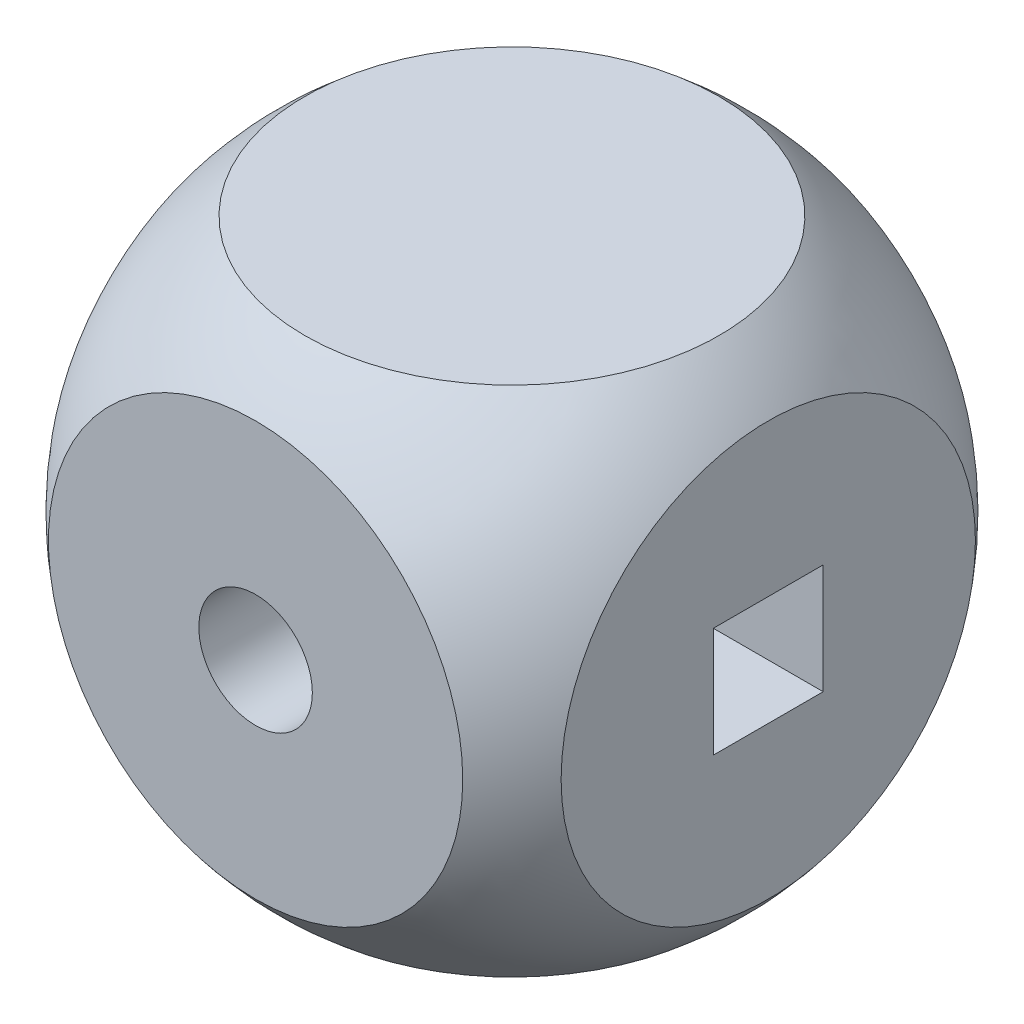
ISO-10303-21;
HEADER;
FILE_DESCRIPTION(('STEP AP214'),'2;1');
FILE_NAME('part.step','',(''),(''),'','','');
FILE_SCHEMA(('AUTOMOTIVE_DESIGN { 1 0 10303 214 1 1 1 1 }'));
ENDSEC;
DATA;
#1=APPLICATION_CONTEXT('core data for automotive mechanical design processes');
#2=APPLICATION_PROTOCOL_DEFINITION('international standard','automotive_design',2000,#1);
#3=PRODUCT_CONTEXT('',#1,'mechanical');
#4=PRODUCT('Part','Part','',(#3));
#5=PRODUCT_RELATED_PRODUCT_CATEGORY('part','',(#4));
#6=PRODUCT_DEFINITION_FORMATION('','',#4);
#7=PRODUCT_DEFINITION_CONTEXT('part definition',#1,'design');
#8=PRODUCT_DEFINITION('design','',#6,#7);
#9=PRODUCT_DEFINITION_SHAPE('','',#8);
#10=(LENGTH_UNIT() NAMED_UNIT(*) SI_UNIT(.MILLI.,.METRE.));
#11=(NAMED_UNIT(*) PLANE_ANGLE_UNIT() SI_UNIT($,.RADIAN.));
#12=(NAMED_UNIT(*) SI_UNIT($,.STERADIAN.) SOLID_ANGLE_UNIT());
#13=UNCERTAINTY_MEASURE_WITH_UNIT(LENGTH_MEASURE(1.E-05),#10,'distance_accuracy_value','');
#14=(GEOMETRIC_REPRESENTATION_CONTEXT(3) GLOBAL_UNCERTAINTY_ASSIGNED_CONTEXT((#13)) GLOBAL_UNIT_ASSIGNED_CONTEXT((#10,
#11,#12)) REPRESENTATION_CONTEXT('',''));
#15=CARTESIAN_POINT('',(0.,0.,0.));
#16=DIRECTION('',(0.,0.,1.));
#17=DIRECTION('',(1.,0.,0.));
#18=AXIS2_PLACEMENT_3D('',#15,#16,#17);
#19=CARTESIAN_POINT('',(0.,0.,0.));
#20=DIRECTION('',(0.,1.,0.));
#21=DIRECTION('',(1.,0.,0.));
#22=AXIS2_PLACEMENT_3D('',#19,#20,#21);
#23=SPHERICAL_SURFACE('',#22,9.);
#24=CARTESIAN_POINT('',(0.,0.,7.));
#25=DIRECTION('',(0.,0.,1.));
#26=DIRECTION('',(1.,0.,0.));
#27=AXIS2_PLACEMENT_3D('',#24,#25,#26);
#28=CIRCLE('',#27,5.65685424949238);
#29=CARTESIAN_POINT('',(5.65685424949238,0.,7.));
#30=VERTEX_POINT('',#29);
#31=EDGE_CURVE('E148',#30,#30,#28,.T.);
#32=ORIENTED_EDGE('',*,*,#31,.F.);
#33=EDGE_LOOP('',(#32));
#34=FACE_BOUND('',#33,.T.);
#35=CARTESIAN_POINT('',(0.,0.,-7.));
#36=DIRECTION('',(0.,0.,-1.));
#37=DIRECTION('',(-1.,0.,0.));
#38=AXIS2_PLACEMENT_3D('',#35,#36,#37);
#39=CIRCLE('',#38,5.65685424949238);
#40=CARTESIAN_POINT('',(-5.65685424949238,0.,-7.));
#41=VERTEX_POINT('',#40);
#42=EDGE_CURVE('E152',#41,#41,#39,.T.);
#43=ORIENTED_EDGE('',*,*,#42,.F.);
#44=EDGE_LOOP('',(#43));
#45=FACE_BOUND('',#44,.T.);
#46=CARTESIAN_POINT('',(0.,7.,0.));
#47=DIRECTION('',(0.,1.,0.));
#48=DIRECTION('',(0.,0.,1.));
#49=AXIS2_PLACEMENT_3D('',#46,#47,#48);
#50=CIRCLE('',#49,5.65685424949238);
#51=CARTESIAN_POINT('',(0.,7.,5.65685424949238));
#52=VERTEX_POINT('',#51);
#53=EDGE_CURVE('E155',#52,#52,#50,.T.);
#54=ORIENTED_EDGE('',*,*,#53,.F.);
#55=EDGE_LOOP('',(#54));
#56=FACE_BOUND('',#55,.T.);
#57=CARTESIAN_POINT('',(0.,-7.,0.));
#58=DIRECTION('',(0.,-1.,0.));
#59=DIRECTION('',(0.,0.,-1.));
#60=AXIS2_PLACEMENT_3D('',#57,#58,#59);
#61=CIRCLE('',#60,5.65685424949238);
#62=CARTESIAN_POINT('',(0.,-7.,-5.65685424949238));
#63=VERTEX_POINT('',#62);
#64=EDGE_CURVE('E158',#63,#63,#61,.T.);
#65=ORIENTED_EDGE('',*,*,#64,.F.);
#66=EDGE_LOOP('',(#65));
#67=FACE_BOUND('',#66,.T.);
#68=CARTESIAN_POINT('',(7.,0.,0.));
#69=DIRECTION('',(1.,0.,0.));
#70=DIRECTION('',(0.,0.,-1.));
#71=AXIS2_PLACEMENT_3D('',#68,#69,#70);
#72=CIRCLE('',#71,5.65685424949238);
#73=CARTESIAN_POINT('',(7.,0.,-5.65685424949238));
#74=VERTEX_POINT('',#73);
#75=EDGE_CURVE('E161',#74,#74,#72,.T.);
#76=ORIENTED_EDGE('',*,*,#75,.F.);
#77=EDGE_LOOP('',(#76));
#78=FACE_BOUND('',#77,.T.);
#79=CARTESIAN_POINT('',(-7.,0.,0.));
#80=DIRECTION('',(-1.,0.,0.));
#81=DIRECTION('',(0.,0.,1.));
#82=AXIS2_PLACEMENT_3D('',#79,#80,#81);
#83=CIRCLE('',#82,5.65685424949238);
#84=CARTESIAN_POINT('',(-7.,0.,5.65685424949238));
#85=VERTEX_POINT('',#84);
#86=EDGE_CURVE('E145',#85,#85,#83,.T.);
#87=ORIENTED_EDGE('',*,*,#86,.F.);
#88=EDGE_LOOP('',(#87));
#89=FACE_BOUND('',#88,.T.);
#90=ADVANCED_FACE('F32',(#34,#45,#56,#67,#78,#89),#23,.T.);
#91=CARTESIAN_POINT('',(0.,0.,7.));
#92=DIRECTION('',(0.,0.,1.));
#93=DIRECTION('',(1.,0.,0.));
#94=AXIS2_PLACEMENT_3D('',#91,#92,#93);
#95=PLANE('',#94);
#96=CARTESIAN_POINT('',(0.,0.,7.));
#97=DIRECTION('',(0.,0.,1.));
#98=DIRECTION('',(1.,0.,0.));
#99=AXIS2_PLACEMENT_3D('',#96,#97,#98);
#100=CIRCLE('',#99,1.55);
#101=CARTESIAN_POINT('',(1.55,0.,7.));
#102=VERTEX_POINT('',#101);
#103=EDGE_CURVE('E141',#102,#102,#100,.T.);
#104=ORIENTED_EDGE('',*,*,#103,.F.);
#105=EDGE_LOOP('',(#104));
#106=FACE_BOUND('',#105,.T.);
#107=ORIENTED_EDGE('',*,*,#31,.T.);
#108=EDGE_LOOP('',(#107));
#109=FACE_BOUND('',#108,.T.);
#110=ADVANCED_FACE('F210',(#106,#109),#95,.T.);
#111=CARTESIAN_POINT('',(0.,0.,-7.));
#112=DIRECTION('',(0.,0.,-1.));
#113=DIRECTION('',(1.,0.,0.));
#114=AXIS2_PLACEMENT_3D('',#111,#112,#113);
#115=PLANE('',#114);
#116=CARTESIAN_POINT('',(0.,0.,-7.));
#117=DIRECTION('',(0.,0.,1.));
#118=DIRECTION('',(1.,0.,0.));
#119=AXIS2_PLACEMENT_3D('',#116,#117,#118);
#120=CIRCLE('',#119,1.55);
#121=CARTESIAN_POINT('',(1.55,0.,-7.));
#122=VERTEX_POINT('',#121);
#123=EDGE_CURVE('E142',#122,#122,#120,.T.);
#124=ORIENTED_EDGE('',*,*,#123,.T.);
#125=EDGE_LOOP('',(#124));
#126=FACE_BOUND('',#125,.T.);
#127=ORIENTED_EDGE('',*,*,#42,.T.);
#128=EDGE_LOOP('',(#127));
#129=FACE_BOUND('',#128,.T.);
#130=ADVANCED_FACE('F215',(#126,#129),#115,.T.);
#131=CARTESIAN_POINT('',(0.,7.,0.));
#132=DIRECTION('',(0.,1.,0.));
#133=DIRECTION('',(0.,0.,1.));
#134=AXIS2_PLACEMENT_3D('',#131,#132,#133);
#135=PLANE('',#134);
#136=ORIENTED_EDGE('',*,*,#53,.T.);
#137=EDGE_LOOP('',(#136));
#138=FACE_BOUND('',#137,.T.);
#139=ADVANCED_FACE('F241',(#138),#135,.T.);
#140=CARTESIAN_POINT('',(0.,-7.,0.));
#141=DIRECTION('',(0.,-1.,0.));
#142=DIRECTION('',(0.,0.,1.));
#143=AXIS2_PLACEMENT_3D('',#140,#141,#142);
#144=PLANE('',#143);
#145=ORIENTED_EDGE('',*,*,#64,.T.);
#146=EDGE_LOOP('',(#145));
#147=FACE_BOUND('',#146,.T.);
#148=ADVANCED_FACE('F235',(#147),#144,.T.);
#149=CARTESIAN_POINT('',(7.,0.,0.));
#150=DIRECTION('',(1.,0.,0.));
#151=DIRECTION('',(0.,0.,-1.));
#152=AXIS2_PLACEMENT_3D('',#149,#150,#151);
#153=PLANE('',#152);
#154=DIRECTION('',(0.,1.,0.));
#155=VECTOR('',#154,1.);
#156=CARTESIAN_POINT('',(7.,1.5,-1.5));
#157=LINE('',#156,#155);
#158=CARTESIAN_POINT('',(7.,-1.5,-1.5));
#159=VERTEX_POINT('',#158);
#160=CARTESIAN_POINT('',(7.,1.5,-1.5));
#161=VERTEX_POINT('',#160);
#162=EDGE_CURVE('E48',#159,#161,#157,.T.);
#163=ORIENTED_EDGE('',*,*,#162,.F.);
#164=DIRECTION('',(0.,0.,-1.));
#165=VECTOR('',#164,1.);
#166=CARTESIAN_POINT('',(7.,-1.5,1.5));
#167=LINE('',#166,#165);
#168=CARTESIAN_POINT('',(7.,-1.5,1.5));
#169=VERTEX_POINT('',#168);
#170=EDGE_CURVE('E121',#169,#159,#167,.T.);
#171=ORIENTED_EDGE('',*,*,#170,.F.);
#172=DIRECTION('',(0.,-1.,0.));
#173=VECTOR('',#172,1.);
#174=CARTESIAN_POINT('',(7.,1.5,1.5));
#175=LINE('',#174,#173);
#176=CARTESIAN_POINT('',(7.,1.5,1.5));
#177=VERTEX_POINT('',#176);
#178=EDGE_CURVE('E104',#177,#169,#175,.T.);
#179=ORIENTED_EDGE('',*,*,#178,.F.);
#180=DIRECTION('',(0.,0.,1.));
#181=VECTOR('',#180,1.);
#182=CARTESIAN_POINT('',(7.,1.5,1.5));
#183=LINE('',#182,#181);
#184=EDGE_CURVE('E113',#161,#177,#183,.T.);
#185=ORIENTED_EDGE('',*,*,#184,.F.);
#186=EDGE_LOOP('',(#163,#171,#179,#185));
#187=FACE_BOUND('',#186,.T.);
#188=ORIENTED_EDGE('',*,*,#75,.T.);
#189=EDGE_LOOP('',(#188));
#190=FACE_BOUND('',#189,.T.);
#191=ADVANCED_FACE('F118',(#187,#190),#153,.T.);
#192=CARTESIAN_POINT('',(-7.,0.,0.));
#193=DIRECTION('',(-1.,0.,0.));
#194=DIRECTION('',(0.,0.,-1.));
#195=AXIS2_PLACEMENT_3D('',#192,#193,#194);
#196=PLANE('',#195);
#197=DIRECTION('',(0.,-1.,0.));
#198=VECTOR('',#197,1.);
#199=CARTESIAN_POINT('',(-7.,0.,-1.5));
#200=LINE('',#199,#198);
#201=CARTESIAN_POINT('',(-7.,1.5,-1.5));
#202=VERTEX_POINT('',#201);
#203=CARTESIAN_POINT('',(-7.,-1.5,-1.5));
#204=VERTEX_POINT('',#203);
#205=EDGE_CURVE('E139',#202,#204,#200,.T.);
#206=ORIENTED_EDGE('',*,*,#205,.F.);
#207=DIRECTION('',(0.,0.,-1.));
#208=VECTOR('',#207,1.);
#209=CARTESIAN_POINT('',(-7.,1.5,0.));
#210=LINE('',#209,#208);
#211=CARTESIAN_POINT('',(-7.,1.5,1.5));
#212=VERTEX_POINT('',#211);
#213=EDGE_CURVE('E133',#212,#202,#210,.T.);
#214=ORIENTED_EDGE('',*,*,#213,.F.);
#215=DIRECTION('',(0.,1.,0.));
#216=VECTOR('',#215,1.);
#217=CARTESIAN_POINT('',(-7.,0.,1.5));
#218=LINE('',#217,#216);
#219=CARTESIAN_POINT('',(-7.,-1.5,1.5));
#220=VERTEX_POINT('',#219);
#221=EDGE_CURVE('E135',#220,#212,#218,.T.);
#222=ORIENTED_EDGE('',*,*,#221,.F.);
#223=DIRECTION('',(0.,0.,1.));
#224=VECTOR('',#223,1.);
#225=CARTESIAN_POINT('',(-7.,-1.5,0.));
#226=LINE('',#225,#224);
#227=EDGE_CURVE('E137',#204,#220,#226,.T.);
#228=ORIENTED_EDGE('',*,*,#227,.F.);
#229=EDGE_LOOP('',(#206,#214,#222,#228));
#230=FACE_BOUND('',#229,.T.);
#231=ORIENTED_EDGE('',*,*,#86,.T.);
#232=EDGE_LOOP('',(#231));
#233=FACE_BOUND('',#232,.T.);
#234=ADVANCED_FACE('F193',(#230,#233),#196,.T.);
#235=CARTESIAN_POINT('',(0.,0.,-7.));
#236=DIRECTION('',(0.,0.,1.));
#237=DIRECTION('',(1.,0.,0.));
#238=AXIS2_PLACEMENT_3D('',#235,#236,#237);
#239=CYLINDRICAL_SURFACE('',#238,1.55);
#240=DIRECTION('',(0.,0.,1.));
#241=VECTOR('',#240,1.);
#242=CARTESIAN_POINT('',(-0.390512483795333,1.5,-7.));
#243=LINE('',#242,#241);
#244=CARTESIAN_POINT('',(-0.390512483795333,1.5,1.5));
#245=VERTEX_POINT('',#244);
#246=CARTESIAN_POINT('',(-0.390512483795333,1.5,-1.5));
#247=VERTEX_POINT('',#246);
#248=EDGE_CURVE('E172',#245,#247,#243,.F.);
#249=ORIENTED_EDGE('',*,*,#248,.T.);
#250=CARTESIAN_POINT('',(0.,0.,-1.5));
#251=DIRECTION('',(0.,0.,-1.));
#252=DIRECTION('',(0.,1.,0.));
#253=AXIS2_PLACEMENT_3D('',#250,#251,#252);
#254=CIRCLE('',#253,1.55);
#255=CARTESIAN_POINT('',(-0.390512483795331,-1.5,-1.5));
#256=VERTEX_POINT('',#255);
#257=EDGE_CURVE('E11',#247,#256,#254,.F.);
#258=ORIENTED_EDGE('',*,*,#257,.T.);
#259=DIRECTION('',(0.,0.,1.));
#260=VECTOR('',#259,1.);
#261=CARTESIAN_POINT('',(-0.390512483795331,-1.5,-7.));
#262=LINE('',#261,#260);
#263=CARTESIAN_POINT('',(-0.390512483795331,-1.5,1.5));
#264=VERTEX_POINT('',#263);
#265=EDGE_CURVE('E35',#256,#264,#262,.T.);
#266=ORIENTED_EDGE('',*,*,#265,.T.);
#267=CARTESIAN_POINT('',(0.,0.,1.5));
#268=DIRECTION('',(0.,0.,1.));
#269=DIRECTION('',(0.,-1.,0.));
#270=AXIS2_PLACEMENT_3D('',#267,#268,#269);
#271=CIRCLE('',#270,1.55);
#272=EDGE_CURVE('E169',#264,#245,#271,.F.);
#273=ORIENTED_EDGE('',*,*,#272,.T.);
#274=EDGE_LOOP('',(#249,#258,#266,#273));
#275=FACE_BOUND('',#274,.T.);
#276=DIRECTION('',(0.,0.,1.));
#277=VECTOR('',#276,1.);
#278=CARTESIAN_POINT('',(0.390512483795331,-1.5,-7.));
#279=LINE('',#278,#277);
#280=CARTESIAN_POINT('',(0.390512483795331,-1.5,1.5));
#281=VERTEX_POINT('',#280);
#282=CARTESIAN_POINT('',(0.390512483795331,-1.5,-1.5));
#283=VERTEX_POINT('',#282);
#284=EDGE_CURVE('E168',#281,#283,#279,.F.);
#285=ORIENTED_EDGE('',*,*,#284,.T.);
#286=CARTESIAN_POINT('',(0.390512483795333,1.5,-1.5));
#287=VERTEX_POINT('',#286);
#288=EDGE_CURVE('E41',#283,#287,#254,.F.);
#289=ORIENTED_EDGE('',*,*,#288,.T.);
#290=DIRECTION('',(0.,0.,1.));
#291=VECTOR('',#290,1.);
#292=CARTESIAN_POINT('',(0.390512483795333,1.5,-7.));
#293=LINE('',#292,#291);
#294=CARTESIAN_POINT('',(0.390512483795333,1.5,1.5));
#295=VERTEX_POINT('',#294);
#296=EDGE_CURVE('E151',#287,#295,#293,.T.);
#297=ORIENTED_EDGE('',*,*,#296,.T.);
#298=EDGE_CURVE('E107',#295,#281,#271,.F.);
#299=ORIENTED_EDGE('',*,*,#298,.T.);
#300=EDGE_LOOP('',(#285,#289,#297,#299));
#301=FACE_BOUND('',#300,.T.);
#302=ORIENTED_EDGE('',*,*,#123,.F.);
#303=EDGE_LOOP('',(#302));
#304=FACE_BOUND('',#303,.T.);
#305=ORIENTED_EDGE('',*,*,#103,.T.);
#306=EDGE_LOOP('',(#305));
#307=FACE_BOUND('',#306,.T.);
#308=ADVANCED_FACE('F177',(#275,#301,#304,#307),#239,.F.);
#309=CARTESIAN_POINT('',(-9.,1.5,1.5));
#310=DIRECTION('',(0.,1.,0.));
#311=DIRECTION('',(0.,0.,1.));
#312=AXIS2_PLACEMENT_3D('',#309,#310,#311);
#313=PLANE('',#312);
#314=DIRECTION('',(1.,0.,0.));
#315=VECTOR('',#314,1.);
#316=CARTESIAN_POINT('',(-9.,1.5,-1.5));
#317=LINE('',#316,#315);
#318=EDGE_CURVE('E115',#287,#161,#317,.T.);
#319=ORIENTED_EDGE('',*,*,#318,.T.);
#320=ORIENTED_EDGE('',*,*,#184,.T.);
#321=DIRECTION('',(1.,0.,0.));
#322=VECTOR('',#321,1.);
#323=CARTESIAN_POINT('',(-9.,1.5,1.5));
#324=LINE('',#323,#322);
#325=EDGE_CURVE('E99',#295,#177,#324,.T.);
#326=ORIENTED_EDGE('',*,*,#325,.F.);
#327=ORIENTED_EDGE('',*,*,#296,.F.);
#328=EDGE_LOOP('',(#319,#320,#326,#327));
#329=FACE_BOUND('',#328,.T.);
#330=ADVANCED_FACE('F114',(#329),#313,.F.);
#331=CARTESIAN_POINT('',(-9.,1.5,1.5));
#332=DIRECTION('',(0.,0.,1.));
#333=DIRECTION('',(0.,-1.,0.));
#334=AXIS2_PLACEMENT_3D('',#331,#332,#333);
#335=PLANE('',#334);
#336=ORIENTED_EDGE('',*,*,#325,.T.);
#337=ORIENTED_EDGE('',*,*,#178,.T.);
#338=DIRECTION('',(1.,0.,0.));
#339=VECTOR('',#338,1.);
#340=CARTESIAN_POINT('',(-9.,-1.5,1.5));
#341=LINE('',#340,#339);
#342=EDGE_CURVE('E130',#281,#169,#341,.T.);
#343=ORIENTED_EDGE('',*,*,#342,.F.);
#344=ORIENTED_EDGE('',*,*,#298,.F.);
#345=EDGE_LOOP('',(#336,#337,#343,#344));
#346=FACE_BOUND('',#345,.T.);
#347=ADVANCED_FACE('F101',(#346),#335,.F.);
#348=CARTESIAN_POINT('',(-9.,-1.5,1.5));
#349=DIRECTION('',(0.,-1.,0.));
#350=DIRECTION('',(0.,0.,-1.));
#351=AXIS2_PLACEMENT_3D('',#348,#349,#350);
#352=PLANE('',#351);
#353=ORIENTED_EDGE('',*,*,#342,.T.);
#354=ORIENTED_EDGE('',*,*,#170,.T.);
#355=DIRECTION('',(1.,0.,0.));
#356=VECTOR('',#355,1.);
#357=CARTESIAN_POINT('',(-9.,-1.5,-1.5));
#358=LINE('',#357,#356);
#359=EDGE_CURVE('E126',#283,#159,#358,.T.);
#360=ORIENTED_EDGE('',*,*,#359,.F.);
#361=ORIENTED_EDGE('',*,*,#284,.F.);
#362=EDGE_LOOP('',(#353,#354,#360,#361));
#363=FACE_BOUND('',#362,.T.);
#364=ADVANCED_FACE('F207',(#363),#352,.F.);
#365=CARTESIAN_POINT('',(-9.,1.5,-1.5));
#366=DIRECTION('',(0.,0.,-1.));
#367=DIRECTION('',(0.,1.,0.));
#368=AXIS2_PLACEMENT_3D('',#365,#366,#367);
#369=PLANE('',#368);
#370=ORIENTED_EDGE('',*,*,#359,.T.);
#371=ORIENTED_EDGE('',*,*,#162,.T.);
#372=ORIENTED_EDGE('',*,*,#318,.F.);
#373=ORIENTED_EDGE('',*,*,#288,.F.);
#374=EDGE_LOOP('',(#370,#371,#372,#373));
#375=FACE_BOUND('',#374,.T.);
#376=ADVANCED_FACE('F303',(#375),#369,.F.);
#377=ORIENTED_EDGE('',*,*,#205,.T.);
#378=EDGE_CURVE('E128',#204,#256,#358,.T.);
#379=ORIENTED_EDGE('',*,*,#378,.T.);
#380=ORIENTED_EDGE('',*,*,#257,.F.);
#381=EDGE_CURVE('E110',#202,#247,#317,.T.);
#382=ORIENTED_EDGE('',*,*,#381,.F.);
#383=EDGE_LOOP('',(#377,#379,#380,#382));
#384=FACE_BOUND('',#383,.T.);
#385=ADVANCED_FACE('F188',(#384),#369,.F.);
#386=ORIENTED_EDGE('',*,*,#227,.T.);
#387=EDGE_CURVE('E129',#220,#264,#341,.T.);
#388=ORIENTED_EDGE('',*,*,#387,.T.);
#389=ORIENTED_EDGE('',*,*,#265,.F.);
#390=ORIENTED_EDGE('',*,*,#378,.F.);
#391=EDGE_LOOP('',(#386,#388,#389,#390));
#392=FACE_BOUND('',#391,.T.);
#393=ADVANCED_FACE('F184',(#392),#352,.F.);
#394=ORIENTED_EDGE('',*,*,#221,.T.);
#395=EDGE_CURVE('E56',#212,#245,#324,.T.);
#396=ORIENTED_EDGE('',*,*,#395,.T.);
#397=ORIENTED_EDGE('',*,*,#272,.F.);
#398=ORIENTED_EDGE('',*,*,#387,.F.);
#399=EDGE_LOOP('',(#394,#396,#397,#398));
#400=FACE_BOUND('',#399,.T.);
#401=ADVANCED_FACE('F197',(#400),#335,.F.);
#402=ORIENTED_EDGE('',*,*,#213,.T.);
#403=ORIENTED_EDGE('',*,*,#381,.T.);
#404=ORIENTED_EDGE('',*,*,#248,.F.);
#405=ORIENTED_EDGE('',*,*,#395,.F.);
#406=EDGE_LOOP('',(#402,#403,#404,#405));
#407=FACE_BOUND('',#406,.T.);
#408=ADVANCED_FACE('F199',(#407),#313,.F.);
#409=CLOSED_SHELL('',(#90,#110,#130,#139,#148,#191,#234,#308,#330,#347,#364,#376,#385,#393,#401,#408));
#410=MANIFOLD_SOLID_BREP('B2',#409);
#411=ADVANCED_BREP_SHAPE_REPRESENTATION('',(#18,#410),#14);
#412=SHAPE_DEFINITION_REPRESENTATION(#9,#411);
ENDSEC;
END-ISO-10303-21;
